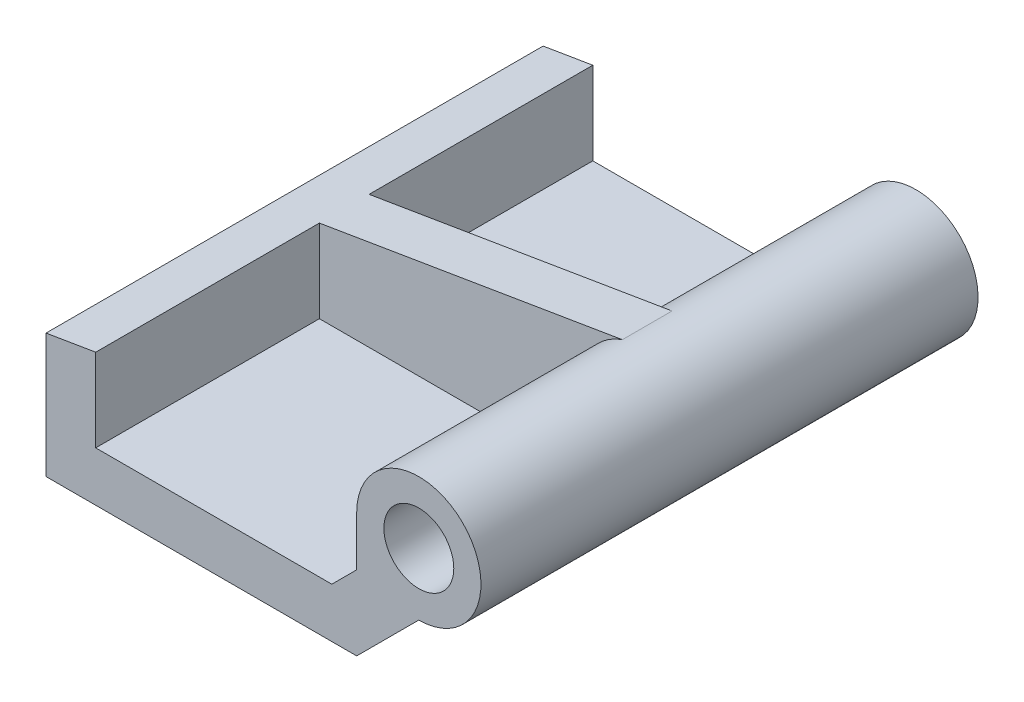
ISO-10303-21;
HEADER;
FILE_DESCRIPTION(('STEP AP214'),'2;1');
FILE_NAME('part.step','',(''),(''),'','','');
FILE_SCHEMA(('AUTOMOTIVE_DESIGN { 1 0 10303 214 1 1 1 1 }'));
ENDSEC;
DATA;
#1=APPLICATION_CONTEXT('core data for automotive mechanical design processes');
#2=APPLICATION_PROTOCOL_DEFINITION('international standard','automotive_design',2000,#1);
#3=PRODUCT_CONTEXT('',#1,'mechanical');
#4=PRODUCT('Part','Part','',(#3));
#5=PRODUCT_RELATED_PRODUCT_CATEGORY('part','',(#4));
#6=PRODUCT_DEFINITION_FORMATION('','',#4);
#7=PRODUCT_DEFINITION_CONTEXT('part definition',#1,'design');
#8=PRODUCT_DEFINITION('design','',#6,#7);
#9=PRODUCT_DEFINITION_SHAPE('','',#8);
#10=(LENGTH_UNIT() NAMED_UNIT(*) SI_UNIT(.MILLI.,.METRE.));
#11=(NAMED_UNIT(*) PLANE_ANGLE_UNIT() SI_UNIT($,.RADIAN.));
#12=(NAMED_UNIT(*) SI_UNIT($,.STERADIAN.) SOLID_ANGLE_UNIT());
#13=UNCERTAINTY_MEASURE_WITH_UNIT(LENGTH_MEASURE(1.E-05),#10,'distance_accuracy_value','');
#14=(GEOMETRIC_REPRESENTATION_CONTEXT(3) GLOBAL_UNCERTAINTY_ASSIGNED_CONTEXT((#13)) GLOBAL_UNIT_ASSIGNED_CONTEXT((#10,
#11,#12)) REPRESENTATION_CONTEXT('',''));
#15=CARTESIAN_POINT('',(0.,0.,0.));
#16=DIRECTION('',(0.,0.,1.));
#17=DIRECTION('',(1.,0.,0.));
#18=AXIS2_PLACEMENT_3D('',#15,#16,#17);
#19=CARTESIAN_POINT('',(-3.30835399750323,19.8501239850194,-25.4));
#20=DIRECTION('',(0.164398987305357,-0.986393923832144,0.));
#21=DIRECTION('',(0.986393923832144,0.164398987305357,0.));
#22=AXIS2_PLACEMENT_3D('',#19,#20,#21);
#23=PLANE('',#22);
#24=DIRECTION('',(0.,0.,-1.));
#25=VECTOR('',#24,1.);
#26=CARTESIAN_POINT('',(7.87796091590998,21.7145098039216,-13.97));
#27=LINE('',#26,#25);
#28=CARTESIAN_POINT('',(7.87796091590998,21.7145098039216,-13.97));
#29=VERTEX_POINT('',#28);
#30=CARTESIAN_POINT('',(7.87796091590998,21.7145098039216,-25.4));
#31=VERTEX_POINT('',#30);
#32=EDGE_CURVE('E196',#29,#31,#27,.T.);
#33=ORIENTED_EDGE('',*,*,#32,.T.);
#34=DIRECTION('',(0.986393923832144,0.164398987305357,0.));
#35=VECTOR('',#34,1.);
#36=CARTESIAN_POINT('',(-3.30835399750323,19.8501239850194,-25.4));
#37=LINE('',#36,#35);
#38=CARTESIAN_POINT('',(5.33796091590998,21.2911764705882,-25.4));
#39=VERTEX_POINT('',#38);
#40=EDGE_CURVE('E100',#39,#31,#37,.T.);
#41=ORIENTED_EDGE('',*,*,#40,.F.);
#42=DIRECTION('',(0.,0.,1.));
#43=VECTOR('',#42,1.);
#44=CARTESIAN_POINT('',(5.33796091590998,21.2911764705882,-25.4));
#45=LINE('',#44,#43);
#46=CARTESIAN_POINT('',(5.33796091590998,21.2911764705882,0.));
#47=VERTEX_POINT('',#46);
#48=EDGE_CURVE('E46',#39,#47,#45,.T.);
#49=ORIENTED_EDGE('',*,*,#48,.T.);
#50=DIRECTION('',(0.986393923832144,0.164398987305357,0.));
#51=VECTOR('',#50,1.);
#52=CARTESIAN_POINT('',(-3.30835399750323,19.8501239850194,0.));
#53=LINE('',#52,#51);
#54=CARTESIAN_POINT('',(7.87796091590998,21.7145098039216,0.));
#55=VERTEX_POINT('',#54);
#56=EDGE_CURVE('E92',#47,#55,#53,.T.);
#57=ORIENTED_EDGE('',*,*,#56,.T.);
#58=DIRECTION('',(0.,0.,1.));
#59=VECTOR('',#58,1.);
#60=CARTESIAN_POINT('',(7.87796091590998,21.7145098039216,-11.43));
#61=LINE('',#60,#59);
#62=CARTESIAN_POINT('',(7.87796091590998,21.7145098039216,-11.43));
#63=VERTEX_POINT('',#62);
#64=EDGE_CURVE('E130',#63,#55,#61,.T.);
#65=ORIENTED_EDGE('',*,*,#64,.F.);
#66=DIRECTION('',(-0.986393923832144,-0.164398987305358,0.));
#67=VECTOR('',#66,1.);
#68=CARTESIAN_POINT('',(23.3582311861803,24.2945548489666,-11.43));
#69=LINE('',#68,#67);
#70=CARTESIAN_POINT('',(23.3582311861803,24.2945548489666,-11.43));
#71=VERTEX_POINT('',#70);
#72=EDGE_CURVE('E182',#71,#63,#69,.T.);
#73=ORIENTED_EDGE('',*,*,#72,.F.);
#74=DIRECTION('',(0.,0.,1.));
#75=VECTOR('',#74,1.);
#76=CARTESIAN_POINT('',(23.3582311861803,24.2945548489666,-34.3802561210692));
#77=LINE('',#76,#75);
#78=CARTESIAN_POINT('',(23.3582311861803,24.2945548489666,-13.97));
#79=VERTEX_POINT('',#78);
#80=EDGE_CURVE('E117',#71,#79,#77,.F.);
#81=ORIENTED_EDGE('',*,*,#80,.T.);
#82=DIRECTION('',(0.986393923832144,0.164398987305357,0.));
#83=VECTOR('',#82,1.);
#84=CARTESIAN_POINT('',(-3.30835399750323,19.8501239850194,-13.97));
#85=LINE('',#84,#83);
#86=EDGE_CURVE('E58',#29,#79,#85,.T.);
#87=ORIENTED_EDGE('',*,*,#86,.F.);
#88=EDGE_LOOP('',(#33,#41,#49,#57,#65,#73,#81,#87));
#89=FACE_BOUND('',#88,.T.);
#90=ADVANCED_FACE('F43',(#89),#23,.F.);
#91=CARTESIAN_POINT('',(0.,0.,-25.4));
#92=DIRECTION('',(0.,0.,1.));
#93=DIRECTION('',(1.,0.,0.));
#94=AXIS2_PLACEMENT_3D('',#91,#92,#93);
#95=PLANE('',#94);
#96=CARTESIAN_POINT('',(24.38796091591,21.2911764705882,-25.4));
#97=DIRECTION('',(0.,0.,1.));
#98=DIRECTION('',(1.,0.,0.));
#99=AXIS2_PLACEMENT_3D('',#96,#97,#98);
#100=CIRCLE('',#99,1.78600099999999);
#101=CARTESIAN_POINT('',(26.17396191591,21.2911764705882,-25.4));
#102=VERTEX_POINT('',#101);
#103=EDGE_CURVE('E236',#102,#102,#100,.T.);
#104=ORIENTED_EDGE('',*,*,#103,.T.);
#105=EDGE_LOOP('',(#104));
#106=FACE_BOUND('',#105,.T.);
#107=DIRECTION('',(0.,1.,0.));
#108=VECTOR('',#107,1.);
#109=CARTESIAN_POINT('',(21.21296091591,0.,-25.4));
#110=LINE('',#109,#108);
#111=CARTESIAN_POINT('',(21.21296091591,18.7511764705882,-25.4));
#112=VERTEX_POINT('',#111);
#113=CARTESIAN_POINT('',(21.21296091591,21.2911764705882,-25.4));
#114=VERTEX_POINT('',#113);
#115=EDGE_CURVE('E232',#112,#114,#110,.T.);
#116=ORIENTED_EDGE('',*,*,#115,.T.);
#117=CARTESIAN_POINT('',(24.38796091591,21.2911764705882,-25.4));
#118=DIRECTION('',(0.,0.,1.));
#119=DIRECTION('',(1.,0.,0.));
#120=AXIS2_PLACEMENT_3D('',#117,#118,#119);
#121=CIRCLE('',#120,3.175);
#122=CARTESIAN_POINT('',(24.38796091591,18.1161764705882,-25.4));
#123=VERTEX_POINT('',#122);
#124=EDGE_CURVE('E121',#114,#123,#121,.F.);
#125=ORIENTED_EDGE('',*,*,#124,.T.);
#126=DIRECTION('',(-0.707106781186542,-0.707106781186553,0.));
#127=VECTOR('',#126,1.);
#128=CARTESIAN_POINT('',(24.38796091591,18.1161764705882,-25.4));
#129=LINE('',#128,#127);
#130=CARTESIAN_POINT('',(21.21296091591,14.9411764705882,-25.4));
#131=VERTEX_POINT('',#130);
#132=EDGE_CURVE('E191',#123,#131,#129,.T.);
#133=ORIENTED_EDGE('',*,*,#132,.T.);
#134=DIRECTION('',(1.,0.,0.));
#135=VECTOR('',#134,1.);
#136=CARTESIAN_POINT('',(0.,14.9411764705882,-25.4));
#137=LINE('',#136,#135);
#138=CARTESIAN_POINT('',(5.33796091590998,14.9411764705882,-25.4));
#139=VERTEX_POINT('',#138);
#140=EDGE_CURVE('E109',#139,#131,#137,.T.);
#141=ORIENTED_EDGE('',*,*,#140,.F.);
#142=DIRECTION('',(0.,1.,0.));
#143=VECTOR('',#142,1.);
#144=CARTESIAN_POINT('',(5.33796091590998,0.,-25.4));
#145=LINE('',#144,#143);
#146=EDGE_CURVE('E81',#139,#39,#145,.T.);
#147=ORIENTED_EDGE('',*,*,#146,.T.);
#148=ORIENTED_EDGE('',*,*,#40,.T.);
#149=DIRECTION('',(0.,-1.,0.));
#150=VECTOR('',#149,1.);
#151=CARTESIAN_POINT('',(7.87796091590998,0.,-25.4));
#152=LINE('',#151,#150);
#153=CARTESIAN_POINT('',(7.87796091590998,17.4811764705882,-25.4));
#154=VERTEX_POINT('',#153);
#155=EDGE_CURVE('E219',#31,#154,#152,.T.);
#156=ORIENTED_EDGE('',*,*,#155,.T.);
#157=DIRECTION('',(1.,0.,0.));
#158=VECTOR('',#157,1.);
#159=CARTESIAN_POINT('',(0.,17.4811764705882,-25.4));
#160=LINE('',#159,#158);
#161=CARTESIAN_POINT('',(19.94296091591,17.4811764705882,-25.4));
#162=VERTEX_POINT('',#161);
#163=EDGE_CURVE('E224',#154,#162,#160,.T.);
#164=ORIENTED_EDGE('',*,*,#163,.T.);
#165=DIRECTION('',(0.707106781186548,0.707106781186548,0.));
#166=VECTOR('',#165,1.);
#167=CARTESIAN_POINT('',(1.23089222266088,-1.23089222266088,-25.4));
#168=LINE('',#167,#166);
#169=EDGE_CURVE('E228',#162,#112,#168,.T.);
#170=ORIENTED_EDGE('',*,*,#169,.T.);
#171=EDGE_LOOP('',(#116,#125,#133,#141,#147,#148,#156,#164,#170));
#172=FACE_BOUND('',#171,.T.);
#173=ADVANCED_FACE('F280',(#106,#172),#95,.F.);
#174=CARTESIAN_POINT('',(0.,14.9411764705882,-25.4));
#175=DIRECTION('',(0.,-1.,0.));
#176=DIRECTION('',(0.,0.,-1.));
#177=AXIS2_PLACEMENT_3D('',#174,#175,#176);
#178=PLANE('',#177);
#179=DIRECTION('',(0.,0.,1.));
#180=VECTOR('',#179,1.);
#181=CARTESIAN_POINT('',(21.21296091591,14.9411764705882,-25.4));
#182=LINE('',#181,#180);
#183=CARTESIAN_POINT('',(21.21296091591,14.9411764705882,0.));
#184=VERTEX_POINT('',#183);
#185=EDGE_CURVE('E98',#131,#184,#182,.T.);
#186=ORIENTED_EDGE('',*,*,#185,.T.);
#187=DIRECTION('',(1.,0.,0.));
#188=VECTOR('',#187,1.);
#189=CARTESIAN_POINT('',(0.,14.9411764705882,0.));
#190=LINE('',#189,#188);
#191=CARTESIAN_POINT('',(5.33796091590998,14.9411764705882,0.));
#192=VERTEX_POINT('',#191);
#193=EDGE_CURVE('E89',#192,#184,#190,.T.);
#194=ORIENTED_EDGE('',*,*,#193,.F.);
#195=DIRECTION('',(0.,0.,1.));
#196=VECTOR('',#195,1.);
#197=CARTESIAN_POINT('',(5.33796091590998,14.9411764705882,-25.4));
#198=LINE('',#197,#196);
#199=EDGE_CURVE('E11',#139,#192,#198,.T.);
#200=ORIENTED_EDGE('',*,*,#199,.F.);
#201=ORIENTED_EDGE('',*,*,#140,.T.);
#202=EDGE_LOOP('',(#186,#194,#200,#201));
#203=FACE_BOUND('',#202,.T.);
#204=ADVANCED_FACE('F96',(#203),#178,.T.);
#205=CARTESIAN_POINT('',(5.33796091590998,0.,-25.4));
#206=DIRECTION('',(1.,0.,0.));
#207=DIRECTION('',(0.,0.,-1.));
#208=AXIS2_PLACEMENT_3D('',#205,#206,#207);
#209=PLANE('',#208);
#210=DIRECTION('',(0.,1.,0.));
#211=VECTOR('',#210,1.);
#212=CARTESIAN_POINT('',(5.33796091590998,0.,0.));
#213=LINE('',#212,#211);
#214=EDGE_CURVE('E79',#192,#47,#213,.T.);
#215=ORIENTED_EDGE('',*,*,#214,.T.);
#216=ORIENTED_EDGE('',*,*,#48,.F.);
#217=ORIENTED_EDGE('',*,*,#146,.F.);
#218=ORIENTED_EDGE('',*,*,#199,.T.);
#219=EDGE_LOOP('',(#215,#216,#217,#218));
#220=FACE_BOUND('',#219,.T.);
#221=ADVANCED_FACE('F77',(#220),#209,.F.);
#222=CARTESIAN_POINT('',(0.,0.,0.));
#223=DIRECTION('',(0.,0.,1.));
#224=DIRECTION('',(1.,0.,0.));
#225=AXIS2_PLACEMENT_3D('',#222,#223,#224);
#226=PLANE('',#225);
#227=CARTESIAN_POINT('',(24.38796091591,21.2911764705882,0.));
#228=DIRECTION('',(0.,0.,1.));
#229=DIRECTION('',(1.,0.,0.));
#230=AXIS2_PLACEMENT_3D('',#227,#228,#229);
#231=CIRCLE('',#230,1.78600099999999);
#232=CARTESIAN_POINT('',(26.17396191591,21.2911764705882,0.));
#233=VERTEX_POINT('',#232);
#234=EDGE_CURVE('E260',#233,#233,#231,.T.);
#235=ORIENTED_EDGE('',*,*,#234,.F.);
#236=EDGE_LOOP('',(#235));
#237=FACE_BOUND('',#236,.T.);
#238=DIRECTION('',(-0.707106781186542,-0.707106781186553,0.));
#239=VECTOR('',#238,1.);
#240=CARTESIAN_POINT('',(24.38796091591,18.1161764705882,0.));
#241=LINE('',#240,#239);
#242=CARTESIAN_POINT('',(24.38796091591,18.1161764705882,0.));
#243=VERTEX_POINT('',#242);
#244=EDGE_CURVE('E192',#243,#184,#241,.T.);
#245=ORIENTED_EDGE('',*,*,#244,.F.);
#246=CARTESIAN_POINT('',(24.38796091591,21.2911764705882,0.));
#247=DIRECTION('',(0.,0.,1.));
#248=DIRECTION('',(1.,0.,0.));
#249=AXIS2_PLACEMENT_3D('',#246,#247,#248);
#250=CIRCLE('',#249,3.175);
#251=CARTESIAN_POINT('',(21.21296091591,21.2911764705882,0.));
#252=VERTEX_POINT('',#251);
#253=EDGE_CURVE('E125',#243,#252,#250,.T.);
#254=ORIENTED_EDGE('',*,*,#253,.T.);
#255=DIRECTION('',(0.,1.,0.));
#256=VECTOR('',#255,1.);
#257=CARTESIAN_POINT('',(21.21296091591,18.7511764705882,0.));
#258=LINE('',#257,#256);
#259=CARTESIAN_POINT('',(21.21296091591,18.7511764705882,0.));
#260=VERTEX_POINT('',#259);
#261=EDGE_CURVE('E150',#260,#252,#258,.T.);
#262=ORIENTED_EDGE('',*,*,#261,.F.);
#263=DIRECTION('',(0.707106781186548,0.707106781186548,0.));
#264=VECTOR('',#263,1.);
#265=CARTESIAN_POINT('',(19.94296091591,17.4811764705882,0.));
#266=LINE('',#265,#264);
#267=CARTESIAN_POINT('',(19.94296091591,17.4811764705882,0.));
#268=VERTEX_POINT('',#267);
#269=EDGE_CURVE('E155',#268,#260,#266,.T.);
#270=ORIENTED_EDGE('',*,*,#269,.F.);
#271=DIRECTION('',(1.,0.,0.));
#272=VECTOR('',#271,1.);
#273=CARTESIAN_POINT('',(7.87796091590998,17.4811764705882,0.));
#274=LINE('',#273,#272);
#275=CARTESIAN_POINT('',(7.87796091590998,17.4811764705882,0.));
#276=VERTEX_POINT('',#275);
#277=EDGE_CURVE('E159',#276,#268,#274,.T.);
#278=ORIENTED_EDGE('',*,*,#277,.F.);
#279=DIRECTION('',(0.,-1.,0.));
#280=VECTOR('',#279,1.);
#281=CARTESIAN_POINT('',(7.87796091590998,21.7145098039216,0.));
#282=LINE('',#281,#280);
#283=EDGE_CURVE('E163',#55,#276,#282,.T.);
#284=ORIENTED_EDGE('',*,*,#283,.F.);
#285=ORIENTED_EDGE('',*,*,#56,.F.);
#286=ORIENTED_EDGE('',*,*,#214,.F.);
#287=ORIENTED_EDGE('',*,*,#193,.T.);
#288=EDGE_LOOP('',(#245,#254,#262,#270,#278,#284,#285,#286,#287));
#289=FACE_BOUND('',#288,.T.);
#290=ADVANCED_FACE('F87',(#237,#289),#226,.T.);
#291=CARTESIAN_POINT('',(24.38796091591,21.2911764705882,-34.3802561210692));
#292=DIRECTION('',(0.,0.,1.));
#293=DIRECTION('',(1.,0.,0.));
#294=AXIS2_PLACEMENT_3D('',#291,#292,#293);
#295=CYLINDRICAL_SURFACE('',#294,3.175);
#296=DIRECTION('',(0.,0.,1.));
#297=VECTOR('',#296,1.);
#298=CARTESIAN_POINT('',(24.38796091591,18.1161764705882,-34.3802561210692));
#299=LINE('',#298,#297);
#300=EDGE_CURVE('E108',#123,#243,#299,.T.);
#301=ORIENTED_EDGE('',*,*,#300,.F.);
#302=ORIENTED_EDGE('',*,*,#124,.F.);
#303=DIRECTION('',(0.,0.,-1.));
#304=VECTOR('',#303,1.);
#305=CARTESIAN_POINT('',(21.21296091591,21.2911764705882,-13.97));
#306=LINE('',#305,#304);
#307=CARTESIAN_POINT('',(21.21296091591,21.2911764705882,-13.97));
#308=VERTEX_POINT('',#307);
#309=EDGE_CURVE('E200',#308,#114,#306,.T.);
#310=ORIENTED_EDGE('',*,*,#309,.F.);
#311=CARTESIAN_POINT('',(24.38796091591,21.2911764705882,-13.97));
#312=DIRECTION('',(0.,0.,-1.));
#313=DIRECTION('',(-1.,0.,0.));
#314=AXIS2_PLACEMENT_3D('',#311,#312,#313);
#315=CIRCLE('',#314,3.175);
#316=EDGE_CURVE('E223',#308,#79,#315,.T.);
#317=ORIENTED_EDGE('',*,*,#316,.T.);
#318=ORIENTED_EDGE('',*,*,#80,.F.);
#319=CARTESIAN_POINT('',(24.38796091591,21.2911764705882,-11.43));
#320=DIRECTION('',(0.,0.,-1.));
#321=DIRECTION('',(1.,0.,0.));
#322=AXIS2_PLACEMENT_3D('',#319,#320,#321);
#323=CIRCLE('',#322,3.175);
#324=CARTESIAN_POINT('',(21.21296091591,21.2911764705882,-11.43));
#325=VERTEX_POINT('',#324);
#326=EDGE_CURVE('E154',#325,#71,#323,.T.);
#327=ORIENTED_EDGE('',*,*,#326,.F.);
#328=DIRECTION('',(0.,0.,1.));
#329=VECTOR('',#328,1.);
#330=CARTESIAN_POINT('',(21.21296091591,21.2911764705882,-11.43));
#331=LINE('',#330,#329);
#332=EDGE_CURVE('E129',#325,#252,#331,.T.);
#333=ORIENTED_EDGE('',*,*,#332,.T.);
#334=ORIENTED_EDGE('',*,*,#253,.F.);
#335=EDGE_LOOP('',(#301,#302,#310,#317,#318,#327,#333,#334));
#336=FACE_BOUND('',#335,.T.);
#337=ADVANCED_FACE('F268',(#336),#295,.T.);
#338=CARTESIAN_POINT('',(21.21296091591,18.7511764705882,-11.43));
#339=DIRECTION('',(1.,0.,0.));
#340=DIRECTION('',(0.,0.,-1.));
#341=AXIS2_PLACEMENT_3D('',#338,#339,#340);
#342=PLANE('',#341);
#343=ORIENTED_EDGE('',*,*,#261,.T.);
#344=ORIENTED_EDGE('',*,*,#332,.F.);
#345=DIRECTION('',(0.,1.,0.));
#346=VECTOR('',#345,1.);
#347=CARTESIAN_POINT('',(21.21296091591,18.7511764705882,-11.43));
#348=LINE('',#347,#346);
#349=CARTESIAN_POINT('',(21.21296091591,18.7511764705882,-11.43));
#350=VERTEX_POINT('',#349);
#351=EDGE_CURVE('E135',#350,#325,#348,.T.);
#352=ORIENTED_EDGE('',*,*,#351,.F.);
#353=DIRECTION('',(0.,0.,1.));
#354=VECTOR('',#353,1.);
#355=CARTESIAN_POINT('',(21.21296091591,18.7511764705882,-11.43));
#356=LINE('',#355,#354);
#357=EDGE_CURVE('E143',#350,#260,#356,.T.);
#358=ORIENTED_EDGE('',*,*,#357,.T.);
#359=EDGE_LOOP('',(#343,#344,#352,#358));
#360=FACE_BOUND('',#359,.T.);
#361=ADVANCED_FACE('F274',(#360),#342,.F.);
#362=CARTESIAN_POINT('',(19.94296091591,17.4811764705882,-11.43));
#363=DIRECTION('',(0.707106781186548,-0.707106781186548,0.));
#364=DIRECTION('',(0.707106781186548,0.707106781186548,0.));
#365=AXIS2_PLACEMENT_3D('',#362,#363,#364);
#366=PLANE('',#365);
#367=ORIENTED_EDGE('',*,*,#269,.T.);
#368=ORIENTED_EDGE('',*,*,#357,.F.);
#369=DIRECTION('',(0.707106781186548,0.707106781186548,0.));
#370=VECTOR('',#369,1.);
#371=CARTESIAN_POINT('',(19.94296091591,17.4811764705882,-11.43));
#372=LINE('',#371,#370);
#373=CARTESIAN_POINT('',(19.94296091591,17.4811764705882,-11.43));
#374=VERTEX_POINT('',#373);
#375=EDGE_CURVE('E170',#374,#350,#372,.T.);
#376=ORIENTED_EDGE('',*,*,#375,.F.);
#377=DIRECTION('',(0.,0.,1.));
#378=VECTOR('',#377,1.);
#379=CARTESIAN_POINT('',(19.94296091591,17.4811764705882,-11.43));
#380=LINE('',#379,#378);
#381=EDGE_CURVE('E139',#374,#268,#380,.T.);
#382=ORIENTED_EDGE('',*,*,#381,.T.);
#383=EDGE_LOOP('',(#367,#368,#376,#382));
#384=FACE_BOUND('',#383,.T.);
#385=ADVANCED_FACE('F396',(#384),#366,.F.);
#386=CARTESIAN_POINT('',(7.87796091590998,17.4811764705882,-11.43));
#387=DIRECTION('',(0.,-1.,0.));
#388=DIRECTION('',(0.,0.,-1.));
#389=AXIS2_PLACEMENT_3D('',#386,#387,#388);
#390=PLANE('',#389);
#391=ORIENTED_EDGE('',*,*,#277,.T.);
#392=ORIENTED_EDGE('',*,*,#381,.F.);
#393=DIRECTION('',(1.,0.,0.));
#394=VECTOR('',#393,1.);
#395=CARTESIAN_POINT('',(7.87796091590998,17.4811764705882,-11.43));
#396=LINE('',#395,#394);
#397=CARTESIAN_POINT('',(7.87796091590998,17.4811764705882,-11.43));
#398=VERTEX_POINT('',#397);
#399=EDGE_CURVE('E174',#398,#374,#396,.T.);
#400=ORIENTED_EDGE('',*,*,#399,.F.);
#401=DIRECTION('',(0.,0.,1.));
#402=VECTOR('',#401,1.);
#403=CARTESIAN_POINT('',(7.87796091590998,17.4811764705882,-11.43));
#404=LINE('',#403,#402);
#405=EDGE_CURVE('E134',#398,#276,#404,.T.);
#406=ORIENTED_EDGE('',*,*,#405,.T.);
#407=EDGE_LOOP('',(#391,#392,#400,#406));
#408=FACE_BOUND('',#407,.T.);
#409=ADVANCED_FACE('F399',(#408),#390,.F.);
#410=CARTESIAN_POINT('',(7.87796091590998,21.7145098039216,-11.43));
#411=DIRECTION('',(-1.,0.,0.));
#412=DIRECTION('',(0.,0.,1.));
#413=AXIS2_PLACEMENT_3D('',#410,#411,#412);
#414=PLANE('',#413);
#415=ORIENTED_EDGE('',*,*,#283,.T.);
#416=ORIENTED_EDGE('',*,*,#405,.F.);
#417=DIRECTION('',(0.,-1.,0.));
#418=VECTOR('',#417,1.);
#419=CARTESIAN_POINT('',(7.87796091590998,21.7145098039216,-11.43));
#420=LINE('',#419,#418);
#421=EDGE_CURVE('E178',#63,#398,#420,.T.);
#422=ORIENTED_EDGE('',*,*,#421,.F.);
#423=ORIENTED_EDGE('',*,*,#64,.T.);
#424=EDGE_LOOP('',(#415,#416,#422,#423));
#425=FACE_BOUND('',#424,.T.);
#426=ADVANCED_FACE('F392',(#425),#414,.F.);
#427=CARTESIAN_POINT('',(24.38796091591,21.2911764705882,-11.43));
#428=DIRECTION('',(0.,0.,1.));
#429=DIRECTION('',(1.,0.,0.));
#430=AXIS2_PLACEMENT_3D('',#427,#428,#429);
#431=PLANE('',#430);
#432=ORIENTED_EDGE('',*,*,#326,.T.);
#433=ORIENTED_EDGE('',*,*,#72,.T.);
#434=ORIENTED_EDGE('',*,*,#421,.T.);
#435=ORIENTED_EDGE('',*,*,#399,.T.);
#436=ORIENTED_EDGE('',*,*,#375,.T.);
#437=ORIENTED_EDGE('',*,*,#351,.T.);
#438=EDGE_LOOP('',(#432,#433,#434,#435,#436,#437));
#439=FACE_BOUND('',#438,.T.);
#440=ADVANCED_FACE('F389',(#439),#431,.T.);
#441=CARTESIAN_POINT('',(24.38796091591,18.1161764705882,-25.4));
#442=DIRECTION('',(-0.707106781186553,0.707106781186542,0.));
#443=DIRECTION('',(-0.707106781186542,-0.707106781186553,0.));
#444=AXIS2_PLACEMENT_3D('',#441,#442,#443);
#445=PLANE('',#444);
#446=ORIENTED_EDGE('',*,*,#244,.T.);
#447=ORIENTED_EDGE('',*,*,#185,.F.);
#448=ORIENTED_EDGE('',*,*,#132,.F.);
#449=ORIENTED_EDGE('',*,*,#300,.T.);
#450=EDGE_LOOP('',(#446,#447,#448,#449));
#451=FACE_BOUND('',#450,.T.);
#452=ADVANCED_FACE('F380',(#451),#445,.F.);
#453=CARTESIAN_POINT('',(7.87796091590998,0.,-13.97));
#454=DIRECTION('',(1.,0.,0.));
#455=DIRECTION('',(0.,0.,-1.));
#456=AXIS2_PLACEMENT_3D('',#453,#454,#455);
#457=PLANE('',#456);
#458=ORIENTED_EDGE('',*,*,#155,.F.);
#459=ORIENTED_EDGE('',*,*,#32,.F.);
#460=DIRECTION('',(0.,-1.,0.));
#461=VECTOR('',#460,1.);
#462=CARTESIAN_POINT('',(7.87796091590998,0.,-13.97));
#463=LINE('',#462,#461);
#464=CARTESIAN_POINT('',(7.87796091590998,17.4811764705882,-13.97));
#465=VERTEX_POINT('',#464);
#466=EDGE_CURVE('E239',#29,#465,#463,.T.);
#467=ORIENTED_EDGE('',*,*,#466,.T.);
#468=DIRECTION('',(0.,0.,-1.));
#469=VECTOR('',#468,1.);
#470=CARTESIAN_POINT('',(7.87796091590998,17.4811764705882,-13.97));
#471=LINE('',#470,#469);
#472=EDGE_CURVE('E212',#465,#154,#471,.T.);
#473=ORIENTED_EDGE('',*,*,#472,.T.);
#474=EDGE_LOOP('',(#458,#459,#467,#473));
#475=FACE_BOUND('',#474,.T.);
#476=ADVANCED_FACE('F376',(#475),#457,.T.);
#477=CARTESIAN_POINT('',(0.,17.4811764705882,-13.97));
#478=DIRECTION('',(0.,1.,0.));
#479=DIRECTION('',(0.,0.,1.));
#480=AXIS2_PLACEMENT_3D('',#477,#478,#479);
#481=PLANE('',#480);
#482=ORIENTED_EDGE('',*,*,#163,.F.);
#483=ORIENTED_EDGE('',*,*,#472,.F.);
#484=DIRECTION('',(1.,0.,0.));
#485=VECTOR('',#484,1.);
#486=CARTESIAN_POINT('',(0.,17.4811764705882,-13.97));
#487=LINE('',#486,#485);
#488=CARTESIAN_POINT('',(19.94296091591,17.4811764705882,-13.97));
#489=VERTEX_POINT('',#488);
#490=EDGE_CURVE('E243',#465,#489,#487,.T.);
#491=ORIENTED_EDGE('',*,*,#490,.T.);
#492=DIRECTION('',(0.,0.,-1.));
#493=VECTOR('',#492,1.);
#494=CARTESIAN_POINT('',(19.94296091591,17.4811764705882,-13.97));
#495=LINE('',#494,#493);
#496=EDGE_CURVE('E208',#489,#162,#495,.T.);
#497=ORIENTED_EDGE('',*,*,#496,.T.);
#498=EDGE_LOOP('',(#482,#483,#491,#497));
#499=FACE_BOUND('',#498,.T.);
#500=ADVANCED_FACE('F379',(#499),#481,.T.);
#501=CARTESIAN_POINT('',(1.23089222266088,-1.23089222266088,-13.97));
#502=DIRECTION('',(-0.707106781186548,0.707106781186548,0.));
#503=DIRECTION('',(-0.707106781186548,-0.707106781186548,0.));
#504=AXIS2_PLACEMENT_3D('',#501,#502,#503);
#505=PLANE('',#504);
#506=ORIENTED_EDGE('',*,*,#169,.F.);
#507=ORIENTED_EDGE('',*,*,#496,.F.);
#508=DIRECTION('',(0.707106781186548,0.707106781186548,0.));
#509=VECTOR('',#508,1.);
#510=CARTESIAN_POINT('',(1.23089222266088,-1.23089222266088,-13.97));
#511=LINE('',#510,#509);
#512=CARTESIAN_POINT('',(21.21296091591,18.7511764705882,-13.97));
#513=VERTEX_POINT('',#512);
#514=EDGE_CURVE('E247',#489,#513,#511,.T.);
#515=ORIENTED_EDGE('',*,*,#514,.T.);
#516=DIRECTION('',(0.,0.,-1.));
#517=VECTOR('',#516,1.);
#518=CARTESIAN_POINT('',(21.21296091591,18.7511764705882,-13.97));
#519=LINE('',#518,#517);
#520=EDGE_CURVE('E204',#513,#112,#519,.T.);
#521=ORIENTED_EDGE('',*,*,#520,.T.);
#522=EDGE_LOOP('',(#506,#507,#515,#521));
#523=FACE_BOUND('',#522,.T.);
#524=ADVANCED_FACE('F373',(#523),#505,.T.);
#525=CARTESIAN_POINT('',(21.21296091591,0.,-13.97));
#526=DIRECTION('',(-1.,0.,0.));
#527=DIRECTION('',(0.,0.,1.));
#528=AXIS2_PLACEMENT_3D('',#525,#526,#527);
#529=PLANE('',#528);
#530=ORIENTED_EDGE('',*,*,#115,.F.);
#531=ORIENTED_EDGE('',*,*,#520,.F.);
#532=DIRECTION('',(0.,1.,0.));
#533=VECTOR('',#532,1.);
#534=CARTESIAN_POINT('',(21.21296091591,0.,-13.97));
#535=LINE('',#534,#533);
#536=EDGE_CURVE('E251',#513,#308,#535,.T.);
#537=ORIENTED_EDGE('',*,*,#536,.T.);
#538=ORIENTED_EDGE('',*,*,#309,.T.);
#539=EDGE_LOOP('',(#530,#531,#537,#538));
#540=FACE_BOUND('',#539,.T.);
#541=ADVANCED_FACE('F361',(#540),#529,.T.);
#542=CARTESIAN_POINT('',(0.,0.,-13.97));
#543=DIRECTION('',(0.,0.,-1.));
#544=DIRECTION('',(-1.,0.,0.));
#545=AXIS2_PLACEMENT_3D('',#542,#543,#544);
#546=PLANE('',#545);
#547=ORIENTED_EDGE('',*,*,#316,.F.);
#548=ORIENTED_EDGE('',*,*,#536,.F.);
#549=ORIENTED_EDGE('',*,*,#514,.F.);
#550=ORIENTED_EDGE('',*,*,#490,.F.);
#551=ORIENTED_EDGE('',*,*,#466,.F.);
#552=ORIENTED_EDGE('',*,*,#86,.T.);
#553=EDGE_LOOP('',(#547,#548,#549,#550,#551,#552));
#554=FACE_BOUND('',#553,.T.);
#555=ADVANCED_FACE('F364',(#554),#546,.T.);
#556=CARTESIAN_POINT('',(24.38796091591,21.2911764705882,0.));
#557=DIRECTION('',(0.,0.,1.));
#558=DIRECTION('',(1.,0.,0.));
#559=AXIS2_PLACEMENT_3D('',#556,#557,#558);
#560=CYLINDRICAL_SURFACE('',#559,1.78600099999999);
#561=ORIENTED_EDGE('',*,*,#103,.F.);
#562=EDGE_LOOP('',(#561));
#563=FACE_BOUND('',#562,.T.);
#564=ORIENTED_EDGE('',*,*,#234,.T.);
#565=EDGE_LOOP('',(#564));
#566=FACE_BOUND('',#565,.T.);
#567=ADVANCED_FACE('F265',(#563,#566),#560,.F.);
#568=CLOSED_SHELL('',(#90,#173,#204,#221,#290,#337,#361,#385,#409,#426,#440,#452,#476,#500,#524,
#541,#555,#567));
#569=MANIFOLD_SOLID_BREP('B2',#568);
#570=ADVANCED_BREP_SHAPE_REPRESENTATION('',(#18,#569),#14);
#571=SHAPE_DEFINITION_REPRESENTATION(#9,#570);
ENDSEC;
END-ISO-10303-21;
